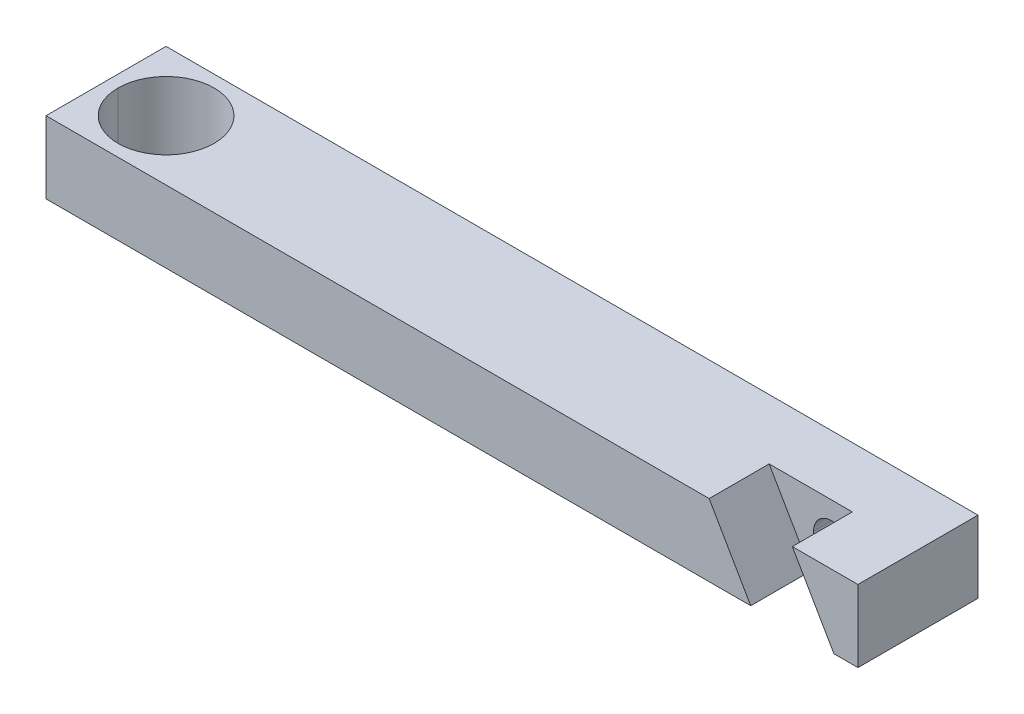
ISO-10303-21;
HEADER;
FILE_DESCRIPTION(('STEP AP214'),'2;1');
FILE_NAME('part.step','',(''),(''),'','','');
FILE_SCHEMA(('AUTOMOTIVE_DESIGN { 1 0 10303 214 1 1 1 1 }'));
ENDSEC;
DATA;
#1=APPLICATION_CONTEXT('core data for automotive mechanical design processes');
#2=APPLICATION_PROTOCOL_DEFINITION('international standard','automotive_design',2000,#1);
#3=PRODUCT_CONTEXT('',#1,'mechanical');
#4=PRODUCT('Part','Part','',(#3));
#5=PRODUCT_RELATED_PRODUCT_CATEGORY('part','',(#4));
#6=PRODUCT_DEFINITION_FORMATION('','',#4);
#7=PRODUCT_DEFINITION_CONTEXT('part definition',#1,'design');
#8=PRODUCT_DEFINITION('design','',#6,#7);
#9=PRODUCT_DEFINITION_SHAPE('','',#8);
#10=(LENGTH_UNIT() NAMED_UNIT(*) SI_UNIT(.MILLI.,.METRE.));
#11=(NAMED_UNIT(*) PLANE_ANGLE_UNIT() SI_UNIT($,.RADIAN.));
#12=(NAMED_UNIT(*) SI_UNIT($,.STERADIAN.) SOLID_ANGLE_UNIT());
#13=UNCERTAINTY_MEASURE_WITH_UNIT(LENGTH_MEASURE(1.E-05),#10,'distance_accuracy_value','');
#14=(GEOMETRIC_REPRESENTATION_CONTEXT(3) GLOBAL_UNCERTAINTY_ASSIGNED_CONTEXT((#13)) GLOBAL_UNIT_ASSIGNED_CONTEXT((#10,
#11,#12)) REPRESENTATION_CONTEXT('',''));
#15=CARTESIAN_POINT('',(0.,0.,0.));
#16=DIRECTION('',(0.,0.,1.));
#17=DIRECTION('',(1.,0.,0.));
#18=AXIS2_PLACEMENT_3D('',#15,#16,#17);
#19=CARTESIAN_POINT('',(0.,93.,0.));
#20=DIRECTION('',(0.,1.,0.));
#21=DIRECTION('',(-1.,0.,0.));
#22=AXIS2_PLACEMENT_3D('',#19,#20,#21);
#23=CYLINDRICAL_SURFACE('',#22,4.);
#24=CARTESIAN_POINT('',(0.,93.,0.));
#25=DIRECTION('',(0.,1.,0.));
#26=DIRECTION('',(-1.,0.,0.));
#27=AXIS2_PLACEMENT_3D('',#24,#25,#26);
#28=CIRCLE('',#27,4.);
#29=CARTESIAN_POINT('',(4.,93.,0.));
#30=VERTEX_POINT('',#29);
#31=CARTESIAN_POINT('',(-4.,93.,0.));
#32=VERTEX_POINT('',#31);
#33=EDGE_CURVE('E41',#30,#32,#28,.T.);
#34=ORIENTED_EDGE('',*,*,#33,.F.);
#35=DIRECTION('',(0.,1.,0.));
#36=VECTOR('',#35,1.);
#37=CARTESIAN_POINT('',(4.,93.,0.));
#38=LINE('',#37,#36);
#39=CARTESIAN_POINT('',(4.,99.,0.));
#40=VERTEX_POINT('',#39);
#41=EDGE_CURVE('E11',#30,#40,#38,.T.);
#42=ORIENTED_EDGE('',*,*,#41,.T.);
#43=CARTESIAN_POINT('',(0.,99.,0.));
#44=DIRECTION('',(0.,1.,0.));
#45=DIRECTION('',(-1.,0.,0.));
#46=AXIS2_PLACEMENT_3D('',#43,#44,#45);
#47=CIRCLE('',#46,4.);
#48=CARTESIAN_POINT('',(-4.,99.,0.));
#49=VERTEX_POINT('',#48);
#50=EDGE_CURVE('E27',#40,#49,#47,.T.);
#51=ORIENTED_EDGE('',*,*,#50,.T.);
#52=DIRECTION('',(0.,1.,0.));
#53=VECTOR('',#52,1.);
#54=CARTESIAN_POINT('',(-4.,93.,0.));
#55=LINE('',#54,#53);
#56=EDGE_CURVE('E646',#32,#49,#55,.T.);
#57=ORIENTED_EDGE('',*,*,#56,.F.);
#58=EDGE_LOOP('',(#34,#42,#51,#57));
#59=FACE_BOUND('',#58,.T.);
#60=ADVANCED_FACE('F16',(#59),#23,.F.);
#61=CARTESIAN_POINT('',(55.4256258422041,96.,-5.));
#62=DIRECTION('',(0.,0.,1.));
#63=DIRECTION('',(1.,0.,0.));
#64=AXIS2_PLACEMENT_3D('',#61,#62,#63);
#65=CYLINDRICAL_SURFACE('',#64,1.5);
#66=CARTESIAN_POINT('',(55.4256258422041,96.,-5.));
#67=DIRECTION('',(0.,0.,1.));
#68=DIRECTION('',(1.,0.,0.));
#69=AXIS2_PLACEMENT_3D('',#66,#67,#68);
#70=CIRCLE('',#69,1.5);
#71=CARTESIAN_POINT('',(53.9256258422041,96.,-5.));
#72=VERTEX_POINT('',#71);
#73=CARTESIAN_POINT('',(56.9256258422041,96.,-5.));
#74=VERTEX_POINT('',#73);
#75=EDGE_CURVE('E175',#72,#74,#70,.T.);
#76=ORIENTED_EDGE('',*,*,#75,.F.);
#77=DIRECTION('',(0.,0.,1.));
#78=VECTOR('',#77,1.);
#79=CARTESIAN_POINT('',(53.9256258422041,96.,-5.));
#80=LINE('',#79,#78);
#81=CARTESIAN_POINT('',(53.9256258422041,96.,0.));
#82=VERTEX_POINT('',#81);
#83=EDGE_CURVE('E183',#72,#82,#80,.T.);
#84=ORIENTED_EDGE('',*,*,#83,.T.);
#85=CARTESIAN_POINT('',(55.4256258422041,96.,0.));
#86=DIRECTION('',(0.,0.,1.));
#87=DIRECTION('',(1.,0.,0.));
#88=AXIS2_PLACEMENT_3D('',#85,#86,#87);
#89=CIRCLE('',#88,1.5);
#90=CARTESIAN_POINT('',(56.9256258422041,96.,0.));
#91=VERTEX_POINT('',#90);
#92=EDGE_CURVE('E200',#82,#91,#89,.T.);
#93=ORIENTED_EDGE('',*,*,#92,.T.);
#94=DIRECTION('',(0.,0.,1.));
#95=VECTOR('',#94,1.);
#96=CARTESIAN_POINT('',(56.9256258422041,96.,-5.));
#97=LINE('',#96,#95);
#98=EDGE_CURVE('E242',#74,#91,#97,.T.);
#99=ORIENTED_EDGE('',*,*,#98,.F.);
#100=EDGE_LOOP('',(#76,#84,#93,#99));
#101=FACE_BOUND('',#100,.T.);
#102=ADVANCED_FACE('F393',(#101),#65,.F.);
#103=CARTESIAN_POINT('',(-5.,93.,5.));
#104=DIRECTION('',(0.,1.,0.));
#105=DIRECTION('',(1.,0.,0.));
#106=AXIS2_PLACEMENT_3D('',#103,#104,#105);
#107=PLANE('',#106);
#108=DIRECTION('',(0.,0.,-1.));
#109=VECTOR('',#108,1.);
#110=CARTESIAN_POINT('',(53.6935750346352,93.,5.));
#111=LINE('',#110,#109);
#112=CARTESIAN_POINT('',(53.6935750346352,93.,5.));
#113=VERTEX_POINT('',#112);
#114=CARTESIAN_POINT('',(53.6935750346352,93.,0.));
#115=VERTEX_POINT('',#114);
#116=EDGE_CURVE('E176',#113,#115,#111,.T.);
#117=ORIENTED_EDGE('',*,*,#116,.F.);
#118=DIRECTION('',(1.,0.,0.));
#119=VECTOR('',#118,1.);
#120=CARTESIAN_POINT('',(-5.,93.,5.));
#121=LINE('',#120,#119);
#122=CARTESIAN_POINT('',(-5.,93.,5.));
#123=VERTEX_POINT('',#122);
#124=EDGE_CURVE('E158',#123,#113,#121,.T.);
#125=ORIENTED_EDGE('',*,*,#124,.F.);
#126=DIRECTION('',(0.,0.,-1.));
#127=VECTOR('',#126,1.);
#128=CARTESIAN_POINT('',(-5.,93.,5.));
#129=LINE('',#128,#127);
#130=CARTESIAN_POINT('',(-5.,93.,-5.));
#131=VERTEX_POINT('',#130);
#132=EDGE_CURVE('E156',#123,#131,#129,.T.);
#133=ORIENTED_EDGE('',*,*,#132,.T.);
#134=DIRECTION('',(1.,0.,0.));
#135=VECTOR('',#134,1.);
#136=CARTESIAN_POINT('',(-5.,93.,-5.));
#137=LINE('',#136,#135);
#138=CARTESIAN_POINT('',(62.6217782649108,93.,-5.));
#139=VERTEX_POINT('',#138);
#140=EDGE_CURVE('E201',#131,#139,#137,.T.);
#141=ORIENTED_EDGE('',*,*,#140,.T.);
#142=DIRECTION('',(0.,0.,-1.));
#143=VECTOR('',#142,1.);
#144=CARTESIAN_POINT('',(62.6217782649108,93.,5.));
#145=LINE('',#144,#143);
#146=CARTESIAN_POINT('',(62.6217782649108,93.,5.));
#147=VERTEX_POINT('',#146);
#148=EDGE_CURVE('E20',#147,#139,#145,.T.);
#149=ORIENTED_EDGE('',*,*,#148,.F.);
#150=DIRECTION('',(1.,0.,0.));
#151=VECTOR('',#150,1.);
#152=CARTESIAN_POINT('',(-5.,93.,5.));
#153=LINE('',#152,#151);
#154=CARTESIAN_POINT('',(60.6217782649108,93.,5.));
#155=VERTEX_POINT('',#154);
#156=EDGE_CURVE('E164',#155,#147,#153,.T.);
#157=ORIENTED_EDGE('',*,*,#156,.F.);
#158=DIRECTION('',(0.,0.,-1.));
#159=VECTOR('',#158,1.);
#160=CARTESIAN_POINT('',(60.6217782649108,93.,5.));
#161=LINE('',#160,#159);
#162=CARTESIAN_POINT('',(60.6217782649108,93.,0.));
#163=VERTEX_POINT('',#162);
#164=EDGE_CURVE('E209',#155,#163,#161,.T.);
#165=ORIENTED_EDGE('',*,*,#164,.T.);
#166=DIRECTION('',(1.,0.,0.));
#167=VECTOR('',#166,1.);
#168=CARTESIAN_POINT('',(60.6217782649108,93.,0.));
#169=LINE('',#168,#167);
#170=EDGE_CURVE('E208',#115,#163,#169,.T.);
#171=ORIENTED_EDGE('',*,*,#170,.F.);
#172=EDGE_LOOP('',(#117,#125,#133,#141,#149,#157,#165,#171));
#173=FACE_BOUND('',#172,.T.);
#174=CARTESIAN_POINT('',(0.,93.,0.));
#175=DIRECTION('',(0.,1.,0.));
#176=DIRECTION('',(-1.,0.,0.));
#177=AXIS2_PLACEMENT_3D('',#174,#175,#176);
#178=CIRCLE('',#177,4.);
#179=EDGE_CURVE('E179',#32,#30,#178,.T.);
#180=ORIENTED_EDGE('',*,*,#179,.T.);
#181=ORIENTED_EDGE('',*,*,#33,.T.);
#182=EDGE_LOOP('',(#180,#181));
#183=FACE_BOUND('',#182,.T.);
#184=ADVANCED_FACE('F388',(#173,#183),#107,.F.);
#185=CARTESIAN_POINT('',(-5.,99.,5.));
#186=DIRECTION('',(0.,-1.,0.));
#187=DIRECTION('',(0.,0.,-1.));
#188=AXIS2_PLACEMENT_3D('',#185,#186,#187);
#189=PLANE('',#188);
#190=DIRECTION('',(0.,0.,-1.));
#191=VECTOR('',#190,1.);
#192=CARTESIAN_POINT('',(50.2294734194976,99.,5.));
#193=LINE('',#192,#191);
#194=CARTESIAN_POINT('',(50.2294734194976,99.,5.));
#195=VERTEX_POINT('',#194);
#196=CARTESIAN_POINT('',(50.2294734194976,99.,0.));
#197=VERTEX_POINT('',#196);
#198=EDGE_CURVE('E168',#195,#197,#193,.T.);
#199=ORIENTED_EDGE('',*,*,#198,.T.);
#200=DIRECTION('',(-1.,0.,0.));
#201=VECTOR('',#200,1.);
#202=CARTESIAN_POINT('',(50.2294734194976,99.,0.));
#203=LINE('',#202,#201);
#204=CARTESIAN_POINT('',(57.1576766497731,99.,0.));
#205=VERTEX_POINT('',#204);
#206=EDGE_CURVE('E238',#205,#197,#203,.T.);
#207=ORIENTED_EDGE('',*,*,#206,.F.);
#208=DIRECTION('',(0.,0.,-1.));
#209=VECTOR('',#208,1.);
#210=CARTESIAN_POINT('',(57.1576766497731,99.,5.));
#211=LINE('',#210,#209);
#212=CARTESIAN_POINT('',(57.1576766497731,99.,5.));
#213=VERTEX_POINT('',#212);
#214=EDGE_CURVE('E192',#213,#205,#211,.T.);
#215=ORIENTED_EDGE('',*,*,#214,.F.);
#216=DIRECTION('',(-1.,0.,0.));
#217=VECTOR('',#216,1.);
#218=CARTESIAN_POINT('',(-5.,99.,5.));
#219=LINE('',#218,#217);
#220=CARTESIAN_POINT('',(62.6217782649108,99.,5.));
#221=VERTEX_POINT('',#220);
#222=EDGE_CURVE('E193',#221,#213,#219,.T.);
#223=ORIENTED_EDGE('',*,*,#222,.F.);
#224=DIRECTION('',(0.,0.,-1.));
#225=VECTOR('',#224,1.);
#226=CARTESIAN_POINT('',(62.6217782649108,99.,5.));
#227=LINE('',#226,#225);
#228=CARTESIAN_POINT('',(62.6217782649108,99.,-5.));
#229=VERTEX_POINT('',#228);
#230=EDGE_CURVE('E202',#221,#229,#227,.T.);
#231=ORIENTED_EDGE('',*,*,#230,.T.);
#232=DIRECTION('',(-1.,0.,0.));
#233=VECTOR('',#232,1.);
#234=CARTESIAN_POINT('',(-5.,99.,-5.));
#235=LINE('',#234,#233);
#236=CARTESIAN_POINT('',(-5.,99.,-5.));
#237=VERTEX_POINT('',#236);
#238=EDGE_CURVE('E134',#229,#237,#235,.T.);
#239=ORIENTED_EDGE('',*,*,#238,.T.);
#240=DIRECTION('',(0.,0.,-1.));
#241=VECTOR('',#240,1.);
#242=CARTESIAN_POINT('',(-5.,99.,5.));
#243=LINE('',#242,#241);
#244=CARTESIAN_POINT('',(-5.,99.,5.));
#245=VERTEX_POINT('',#244);
#246=EDGE_CURVE('E130',#245,#237,#243,.T.);
#247=ORIENTED_EDGE('',*,*,#246,.F.);
#248=DIRECTION('',(-1.,0.,0.));
#249=VECTOR('',#248,1.);
#250=CARTESIAN_POINT('',(-5.,99.,5.));
#251=LINE('',#250,#249);
#252=EDGE_CURVE('E124',#195,#245,#251,.T.);
#253=ORIENTED_EDGE('',*,*,#252,.F.);
#254=EDGE_LOOP('',(#199,#207,#215,#223,#231,#239,#247,#253));
#255=FACE_BOUND('',#254,.T.);
#256=CARTESIAN_POINT('',(0.,99.,0.));
#257=DIRECTION('',(0.,1.,0.));
#258=DIRECTION('',(-1.,0.,0.));
#259=AXIS2_PLACEMENT_3D('',#256,#257,#258);
#260=CIRCLE('',#259,4.);
#261=EDGE_CURVE('E652',#49,#40,#260,.T.);
#262=ORIENTED_EDGE('',*,*,#261,.F.);
#263=ORIENTED_EDGE('',*,*,#50,.F.);
#264=EDGE_LOOP('',(#262,#263));
#265=FACE_BOUND('',#264,.T.);
#266=ADVANCED_FACE('F131',(#255,#265),#189,.F.);
#267=CARTESIAN_POINT('',(0.,0.,5.));
#268=DIRECTION('',(0.,0.,-1.));
#269=DIRECTION('',(0.,-1.,0.));
#270=AXIS2_PLACEMENT_3D('',#267,#268,#269);
#271=PLANE('',#270);
#272=DIRECTION('',(0.499999999999981,-0.86602540378445,0.));
#273=VECTOR('',#272,1.);
#274=CARTESIAN_POINT('',(53.6935750346352,93.,5.));
#275=LINE('',#274,#273);
#276=EDGE_CURVE('E150',#195,#113,#275,.T.);
#277=ORIENTED_EDGE('',*,*,#276,.F.);
#278=ORIENTED_EDGE('',*,*,#252,.T.);
#279=DIRECTION('',(0.,-1.,0.));
#280=VECTOR('',#279,1.);
#281=CARTESIAN_POINT('',(-5.,93.,5.));
#282=LINE('',#281,#280);
#283=EDGE_CURVE('E148',#245,#123,#282,.T.);
#284=ORIENTED_EDGE('',*,*,#283,.T.);
#285=ORIENTED_EDGE('',*,*,#124,.T.);
#286=EDGE_LOOP('',(#277,#278,#284,#285));
#287=FACE_BOUND('',#286,.T.);
#288=ADVANCED_FACE('F146',(#287),#271,.F.);
#289=CARTESIAN_POINT('',(0.,0.,5.));
#290=DIRECTION('',(0.,0.,-1.));
#291=DIRECTION('',(0.,-1.,0.));
#292=AXIS2_PLACEMENT_3D('',#289,#290,#291);
#293=PLANE('',#292);
#294=DIRECTION('',(-0.5,0.866025403784439,0.));
#295=VECTOR('',#294,1.);
#296=CARTESIAN_POINT('',(57.1576766497731,99.,5.));
#297=LINE('',#296,#295);
#298=EDGE_CURVE('E188',#155,#213,#297,.T.);
#299=ORIENTED_EDGE('',*,*,#298,.F.);
#300=ORIENTED_EDGE('',*,*,#156,.T.);
#301=DIRECTION('',(0.,1.,0.));
#302=VECTOR('',#301,1.);
#303=CARTESIAN_POINT('',(62.6217782649108,99.,5.));
#304=LINE('',#303,#302);
#305=EDGE_CURVE('E196',#147,#221,#304,.T.);
#306=ORIENTED_EDGE('',*,*,#305,.T.);
#307=ORIENTED_EDGE('',*,*,#222,.T.);
#308=EDGE_LOOP('',(#299,#300,#306,#307));
#309=FACE_BOUND('',#308,.T.);
#310=ADVANCED_FACE('F404',(#309),#293,.F.);
#311=CARTESIAN_POINT('',(-5.,93.,5.));
#312=DIRECTION('',(1.,0.,0.));
#313=DIRECTION('',(0.,1.,0.));
#314=AXIS2_PLACEMENT_3D('',#311,#312,#313);
#315=PLANE('',#314);
#316=DIRECTION('',(0.,-1.,0.));
#317=VECTOR('',#316,1.);
#318=CARTESIAN_POINT('',(-5.,93.,-5.));
#319=LINE('',#318,#317);
#320=EDGE_CURVE('E140',#237,#131,#319,.T.);
#321=ORIENTED_EDGE('',*,*,#320,.T.);
#322=ORIENTED_EDGE('',*,*,#132,.F.);
#323=ORIENTED_EDGE('',*,*,#283,.F.);
#324=ORIENTED_EDGE('',*,*,#246,.T.);
#325=EDGE_LOOP('',(#321,#322,#323,#324));
#326=FACE_BOUND('',#325,.T.);
#327=ADVANCED_FACE('F154',(#326),#315,.F.);
#328=CARTESIAN_POINT('',(62.6217782649108,99.,5.));
#329=DIRECTION('',(-1.,0.,0.));
#330=DIRECTION('',(0.,0.,1.));
#331=AXIS2_PLACEMENT_3D('',#328,#329,#330);
#332=PLANE('',#331);
#333=DIRECTION('',(0.,1.,0.));
#334=VECTOR('',#333,1.);
#335=CARTESIAN_POINT('',(62.6217782649108,99.,-5.));
#336=LINE('',#335,#334);
#337=EDGE_CURVE('E141',#139,#229,#336,.T.);
#338=ORIENTED_EDGE('',*,*,#337,.T.);
#339=ORIENTED_EDGE('',*,*,#230,.F.);
#340=ORIENTED_EDGE('',*,*,#305,.F.);
#341=ORIENTED_EDGE('',*,*,#148,.T.);
#342=EDGE_LOOP('',(#338,#339,#340,#341));
#343=FACE_BOUND('',#342,.T.);
#344=ADVANCED_FACE('F403',(#343),#332,.F.);
#345=CARTESIAN_POINT('',(0.,0.,-5.));
#346=DIRECTION('',(0.,0.,-1.));
#347=DIRECTION('',(0.,-1.,0.));
#348=AXIS2_PLACEMENT_3D('',#345,#346,#347);
#349=PLANE('',#348);
#350=ORIENTED_EDGE('',*,*,#320,.F.);
#351=ORIENTED_EDGE('',*,*,#238,.F.);
#352=ORIENTED_EDGE('',*,*,#337,.F.);
#353=ORIENTED_EDGE('',*,*,#140,.F.);
#354=EDGE_LOOP('',(#350,#351,#352,#353));
#355=FACE_BOUND('',#354,.T.);
#356=CARTESIAN_POINT('',(55.4256258422041,96.,-5.));
#357=DIRECTION('',(0.,0.,1.));
#358=DIRECTION('',(1.,0.,0.));
#359=AXIS2_PLACEMENT_3D('',#356,#357,#358);
#360=CIRCLE('',#359,1.5);
#361=EDGE_CURVE('E184',#74,#72,#360,.T.);
#362=ORIENTED_EDGE('',*,*,#361,.T.);
#363=ORIENTED_EDGE('',*,*,#75,.T.);
#364=EDGE_LOOP('',(#362,#363));
#365=FACE_BOUND('',#364,.T.);
#366=ADVANCED_FACE('F416',(#355,#365),#349,.T.);
#367=CARTESIAN_POINT('',(53.6935750346352,93.,5.));
#368=DIRECTION('',(0.86602540378445,0.499999999999981,0.));
#369=DIRECTION('',(0.,0.,-1.));
#370=AXIS2_PLACEMENT_3D('',#367,#368,#369);
#371=PLANE('',#370);
#372=DIRECTION('',(0.499999999999981,-0.86602540378445,0.));
#373=VECTOR('',#372,1.);
#374=CARTESIAN_POINT('',(53.6935750346352,93.,0.));
#375=LINE('',#374,#373);
#376=EDGE_CURVE('E205',#197,#115,#375,.T.);
#377=ORIENTED_EDGE('',*,*,#376,.F.);
#378=ORIENTED_EDGE('',*,*,#198,.F.);
#379=ORIENTED_EDGE('',*,*,#276,.T.);
#380=ORIENTED_EDGE('',*,*,#116,.T.);
#381=EDGE_LOOP('',(#377,#378,#379,#380));
#382=FACE_BOUND('',#381,.T.);
#383=ADVANCED_FACE('F411',(#382),#371,.T.);
#384=CARTESIAN_POINT('',(57.1576766497731,99.,5.));
#385=DIRECTION('',(-0.866025403784439,-0.5,0.));
#386=DIRECTION('',(-0.5,0.866025403784439,0.));
#387=AXIS2_PLACEMENT_3D('',#384,#385,#386);
#388=PLANE('',#387);
#389=DIRECTION('',(-0.5,0.866025403784439,0.));
#390=VECTOR('',#389,1.);
#391=CARTESIAN_POINT('',(57.1576766497731,99.,0.));
#392=LINE('',#391,#390);
#393=EDGE_CURVE('E241',#163,#205,#392,.T.);
#394=ORIENTED_EDGE('',*,*,#393,.F.);
#395=ORIENTED_EDGE('',*,*,#164,.F.);
#396=ORIENTED_EDGE('',*,*,#298,.T.);
#397=ORIENTED_EDGE('',*,*,#214,.T.);
#398=EDGE_LOOP('',(#394,#395,#396,#397));
#399=FACE_BOUND('',#398,.T.);
#400=ADVANCED_FACE('F415',(#399),#388,.T.);
#401=CARTESIAN_POINT('',(0.,0.,0.));
#402=DIRECTION('',(0.,0.,-1.));
#403=DIRECTION('',(0.,-1.,0.));
#404=AXIS2_PLACEMENT_3D('',#401,#402,#403);
#405=PLANE('',#404);
#406=ORIENTED_EDGE('',*,*,#376,.T.);
#407=ORIENTED_EDGE('',*,*,#170,.T.);
#408=ORIENTED_EDGE('',*,*,#393,.T.);
#409=ORIENTED_EDGE('',*,*,#206,.T.);
#410=EDGE_LOOP('',(#406,#407,#408,#409));
#411=FACE_BOUND('',#410,.T.);
#412=CARTESIAN_POINT('',(55.4256258422041,96.,0.));
#413=DIRECTION('',(0.,0.,1.));
#414=DIRECTION('',(1.,0.,0.));
#415=AXIS2_PLACEMENT_3D('',#412,#413,#414);
#416=CIRCLE('',#415,1.5);
#417=EDGE_CURVE('E642',#91,#82,#416,.T.);
#418=ORIENTED_EDGE('',*,*,#417,.F.);
#419=ORIENTED_EDGE('',*,*,#92,.F.);
#420=EDGE_LOOP('',(#418,#419));
#421=FACE_BOUND('',#420,.T.);
#422=ADVANCED_FACE('F443',(#411,#421),#405,.F.);
#423=CARTESIAN_POINT('',(55.4256258422041,96.,-5.));
#424=DIRECTION('',(0.,0.,1.));
#425=DIRECTION('',(1.,0.,0.));
#426=AXIS2_PLACEMENT_3D('',#423,#424,#425);
#427=CYLINDRICAL_SURFACE('',#426,1.5);
#428=ORIENTED_EDGE('',*,*,#83,.F.);
#429=ORIENTED_EDGE('',*,*,#361,.F.);
#430=ORIENTED_EDGE('',*,*,#98,.T.);
#431=ORIENTED_EDGE('',*,*,#417,.T.);
#432=EDGE_LOOP('',(#428,#429,#430,#431));
#433=FACE_BOUND('',#432,.T.);
#434=ADVANCED_FACE('F447',(#433),#427,.F.);
#435=CARTESIAN_POINT('',(0.,93.,0.));
#436=DIRECTION('',(0.,1.,0.));
#437=DIRECTION('',(-1.,0.,0.));
#438=AXIS2_PLACEMENT_3D('',#435,#436,#437);
#439=CYLINDRICAL_SURFACE('',#438,4.);
#440=ORIENTED_EDGE('',*,*,#41,.F.);
#441=ORIENTED_EDGE('',*,*,#179,.F.);
#442=ORIENTED_EDGE('',*,*,#56,.T.);
#443=ORIENTED_EDGE('',*,*,#261,.T.);
#444=EDGE_LOOP('',(#440,#441,#442,#443));
#445=FACE_BOUND('',#444,.T.);
#446=ADVANCED_FACE('F18',(#445),#439,.F.);
#447=CLOSED_SHELL('',(#60,#102,#184,#266,#288,#310,#327,#344,#366,#383,#400,#422,#434,#446));
#448=MANIFOLD_SOLID_BREP('B1',#447);
#449=ADVANCED_BREP_SHAPE_REPRESENTATION('',(#18,#448),#14);
#450=SHAPE_DEFINITION_REPRESENTATION(#9,#449);
ENDSEC;
END-ISO-10303-21;
